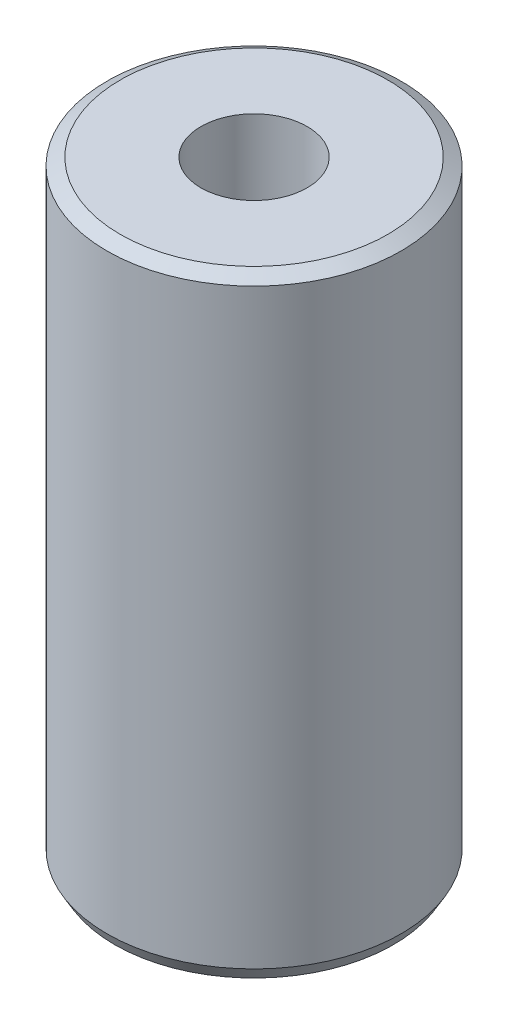
ISO-10303-21;
HEADER;
FILE_DESCRIPTION(('STEP AP214'),'2;1');
FILE_NAME('part.step','',(''),(''),'','','');
FILE_SCHEMA(('AUTOMOTIVE_DESIGN { 1 0 10303 214 1 1 1 1 }'));
ENDSEC;
DATA;
#1=APPLICATION_CONTEXT('core data for automotive mechanical design processes');
#2=APPLICATION_PROTOCOL_DEFINITION('international standard','automotive_design',2000,#1);
#3=PRODUCT_CONTEXT('',#1,'mechanical');
#4=PRODUCT('Part','Part','',(#3));
#5=PRODUCT_RELATED_PRODUCT_CATEGORY('part','',(#4));
#6=PRODUCT_DEFINITION_FORMATION('','',#4);
#7=PRODUCT_DEFINITION_CONTEXT('part definition',#1,'design');
#8=PRODUCT_DEFINITION('design','',#6,#7);
#9=PRODUCT_DEFINITION_SHAPE('','',#8);
#10=(LENGTH_UNIT() NAMED_UNIT(*) SI_UNIT(.MILLI.,.METRE.));
#11=(NAMED_UNIT(*) PLANE_ANGLE_UNIT() SI_UNIT($,.RADIAN.));
#12=(NAMED_UNIT(*) SI_UNIT($,.STERADIAN.) SOLID_ANGLE_UNIT());
#13=UNCERTAINTY_MEASURE_WITH_UNIT(LENGTH_MEASURE(1.E-05),#10,'distance_accuracy_value','');
#14=(GEOMETRIC_REPRESENTATION_CONTEXT(3) GLOBAL_UNCERTAINTY_ASSIGNED_CONTEXT((#13)) GLOBAL_UNIT_ASSIGNED_CONTEXT((#10,
#11,#12)) REPRESENTATION_CONTEXT('',''));
#15=CARTESIAN_POINT('',(0.,0.,0.));
#16=DIRECTION('',(0.,0.,1.));
#17=DIRECTION('',(1.,0.,0.));
#18=AXIS2_PLACEMENT_3D('',#15,#16,#17);
#19=CARTESIAN_POINT('',(0.,72.8392816559873,0.));
#20=DIRECTION('',(0.,-1.,0.));
#21=DIRECTION('',(0.,0.,-1.));
#22=AXIS2_PLACEMENT_3D('',#19,#20,#21);
#23=CYLINDRICAL_SURFACE('',#22,17.5);
#24=CARTESIAN_POINT('',(0.,71.9245733676853,0.));
#25=DIRECTION('',(0.,1.,0.));
#26=DIRECTION('',(0.,0.,1.));
#27=AXIS2_PLACEMENT_3D('',#24,#25,#26);
#28=CIRCLE('',#27,17.5);
#29=CARTESIAN_POINT('',(0.,71.9245733676853,17.5));
#30=VERTEX_POINT('',#29);
#31=EDGE_CURVE('E50',#30,#30,#28,.F.);
#32=ORIENTED_EDGE('',*,*,#31,.T.);
#33=EDGE_LOOP('',(#32));
#34=FACE_BOUND('',#33,.T.);
#35=CARTESIAN_POINT('',(0.,1.58432122944344,0.));
#36=DIRECTION('',(0.,1.,0.));
#37=DIRECTION('',(0.,0.,1.));
#38=AXIS2_PLACEMENT_3D('',#35,#36,#37);
#39=CIRCLE('',#38,17.5);
#40=CARTESIAN_POINT('',(0.,1.58432122944344,17.5));
#41=VERTEX_POINT('',#40);
#42=EDGE_CURVE('E51',#41,#41,#39,.T.);
#43=ORIENTED_EDGE('',*,*,#42,.T.);
#44=EDGE_LOOP('',(#43));
#45=FACE_BOUND('',#44,.T.);
#46=ADVANCED_FACE('F39',(#34,#45),#23,.T.);
#47=CARTESIAN_POINT('',(0.,72.8392816559873,0.));
#48=DIRECTION('',(0.,1.,0.));
#49=DIRECTION('',(0.,0.,1.));
#50=AXIS2_PLACEMENT_3D('',#47,#48,#49);
#51=PLANE('',#50);
#52=CARTESIAN_POINT('',(0.,72.8392816559873,0.));
#53=DIRECTION('',(0.,1.,0.));
#54=DIRECTION('',(0.,0.,1.));
#55=AXIS2_PLACEMENT_3D('',#52,#53,#54);
#56=CIRCLE('',#55,15.9156787705566);
#57=CARTESIAN_POINT('',(0.,72.8392816559873,15.9156787705566));
#58=VERTEX_POINT('',#57);
#59=EDGE_CURVE('E54',#58,#58,#56,.T.);
#60=ORIENTED_EDGE('',*,*,#59,.T.);
#61=EDGE_LOOP('',(#60));
#62=FACE_BOUND('',#61,.T.);
#63=CARTESIAN_POINT('',(0.,72.8392816559873,0.));
#64=DIRECTION('',(0.,1.,0.));
#65=DIRECTION('',(0.,0.,1.));
#66=AXIS2_PLACEMENT_3D('',#63,#64,#65);
#67=CIRCLE('',#66,6.32219985334889);
#68=CARTESIAN_POINT('',(0.,72.8392816559873,6.32219985334889));
#69=VERTEX_POINT('',#68);
#70=EDGE_CURVE('E58',#69,#69,#67,.T.);
#71=ORIENTED_EDGE('',*,*,#70,.F.);
#72=EDGE_LOOP('',(#71));
#73=FACE_BOUND('',#72,.T.);
#74=ADVANCED_FACE('F69',(#62,#73),#51,.T.);
#75=CARTESIAN_POINT('',(0.,0.,0.));
#76=DIRECTION('',(0.,1.,0.));
#77=DIRECTION('',(0.,0.,1.));
#78=AXIS2_PLACEMENT_3D('',#75,#76,#77);
#79=PLANE('',#78);
#80=CARTESIAN_POINT('',(0.,0.,0.));
#81=DIRECTION('',(0.,1.,0.));
#82=DIRECTION('',(0.,0.,1.));
#83=AXIS2_PLACEMENT_3D('',#80,#81,#82);
#84=CIRCLE('',#83,16.585291711698);
#85=CARTESIAN_POINT('',(0.,0.,16.585291711698));
#86=VERTEX_POINT('',#85);
#87=EDGE_CURVE('E10',#86,#86,#84,.F.);
#88=ORIENTED_EDGE('',*,*,#87,.T.);
#89=EDGE_LOOP('',(#88));
#90=FACE_BOUND('',#89,.T.);
#91=CARTESIAN_POINT('',(0.,0.,0.));
#92=DIRECTION('',(0.,1.,0.));
#93=DIRECTION('',(0.,0.,1.));
#94=AXIS2_PLACEMENT_3D('',#91,#92,#93);
#95=CIRCLE('',#94,6.32219985334889);
#96=CARTESIAN_POINT('',(0.,0.,6.32219985334889));
#97=VERTEX_POINT('',#96);
#98=EDGE_CURVE('E63',#97,#97,#95,.T.);
#99=ORIENTED_EDGE('',*,*,#98,.T.);
#100=EDGE_LOOP('',(#99));
#101=FACE_BOUND('',#100,.T.);
#102=ADVANCED_FACE('F75',(#90,#101),#79,.F.);
#103=CARTESIAN_POINT('',(0.,72.8392816559873,0.));
#104=DIRECTION('',(0.,-1.,0.));
#105=DIRECTION('',(0.,0.,-1.));
#106=AXIS2_PLACEMENT_3D('',#103,#104,#105);
#107=CYLINDRICAL_SURFACE('',#106,6.32219985334889);
#108=ORIENTED_EDGE('',*,*,#70,.T.);
#109=EDGE_LOOP('',(#108));
#110=FACE_BOUND('',#109,.T.);
#111=ORIENTED_EDGE('',*,*,#98,.F.);
#112=EDGE_LOOP('',(#111));
#113=FACE_BOUND('',#112,.T.);
#114=ADVANCED_FACE('F70',(#110,#113),#107,.F.);
#115=CARTESIAN_POINT('',(0.,72.8392816559873,0.));
#116=DIRECTION('',(0.,-1.,0.));
#117=DIRECTION('',(0.,0.,-1.));
#118=AXIS2_PLACEMENT_3D('',#115,#116,#117);
#119=CONICAL_SURFACE('',#118,15.9156787705566,1.04719755119659);
#120=ORIENTED_EDGE('',*,*,#31,.F.);
#121=EDGE_LOOP('',(#120));
#122=FACE_BOUND('',#121,.T.);
#123=ORIENTED_EDGE('',*,*,#59,.F.);
#124=EDGE_LOOP('',(#123));
#125=FACE_BOUND('',#124,.T.);
#126=ADVANCED_FACE('F81',(#122,#125),#119,.T.);
#127=CARTESIAN_POINT('',(0.,1.58432122944344,0.));
#128=DIRECTION('',(0.,1.,0.));
#129=DIRECTION('',(0.,0.,1.));
#130=AXIS2_PLACEMENT_3D('',#127,#128,#129);
#131=CONICAL_SURFACE('',#130,17.5,0.523598775598299);
#132=ORIENTED_EDGE('',*,*,#87,.F.);
#133=EDGE_LOOP('',(#132));
#134=FACE_BOUND('',#133,.T.);
#135=ORIENTED_EDGE('',*,*,#42,.F.);
#136=EDGE_LOOP('',(#135));
#137=FACE_BOUND('',#136,.T.);
#138=ADVANCED_FACE('F45',(#134,#137),#131,.T.);
#139=CLOSED_SHELL('',(#46,#74,#102,#114,#126,#138));
#140=MANIFOLD_SOLID_BREP('B2',#139);
#141=ADVANCED_BREP_SHAPE_REPRESENTATION('',(#18,#140),#14);
#142=SHAPE_DEFINITION_REPRESENTATION(#9,#141);
ENDSEC;
END-ISO-10303-21;
